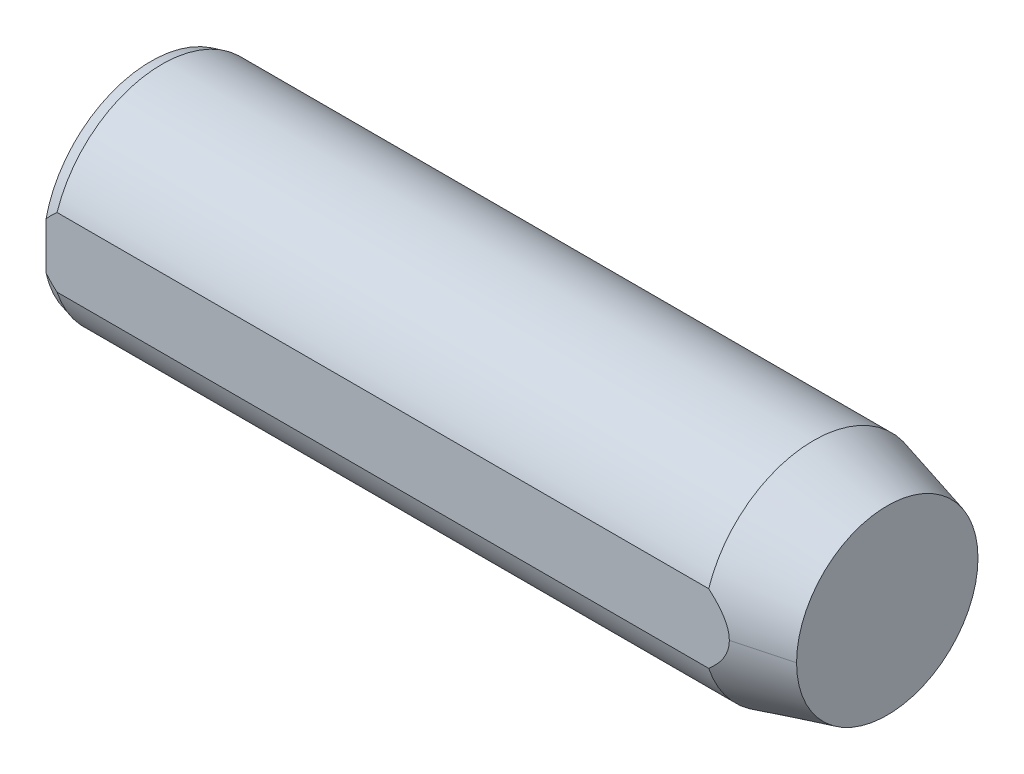
ISO-10303-21;
HEADER;
FILE_DESCRIPTION(('STEP AP214'),'2;1');
FILE_NAME('part.step','',(''),(''),'','','');
FILE_SCHEMA(('AUTOMOTIVE_DESIGN { 1 0 10303 214 1 1 1 1 }'));
ENDSEC;
DATA;
#1=APPLICATION_CONTEXT('core data for automotive mechanical design processes');
#2=APPLICATION_PROTOCOL_DEFINITION('international standard','automotive_design',2000,#1);
#3=PRODUCT_CONTEXT('',#1,'mechanical');
#4=PRODUCT('Part','Part','',(#3));
#5=PRODUCT_RELATED_PRODUCT_CATEGORY('part','',(#4));
#6=PRODUCT_DEFINITION_FORMATION('','',#4);
#7=PRODUCT_DEFINITION_CONTEXT('part definition',#1,'design');
#8=PRODUCT_DEFINITION('design','',#6,#7);
#9=PRODUCT_DEFINITION_SHAPE('','',#8);
#10=(LENGTH_UNIT() NAMED_UNIT(*) SI_UNIT(.MILLI.,.METRE.));
#11=(NAMED_UNIT(*) PLANE_ANGLE_UNIT() SI_UNIT($,.RADIAN.));
#12=(NAMED_UNIT(*) SI_UNIT($,.STERADIAN.) SOLID_ANGLE_UNIT());
#13=UNCERTAINTY_MEASURE_WITH_UNIT(LENGTH_MEASURE(1.E-05),#10,'distance_accuracy_value','');
#14=(GEOMETRIC_REPRESENTATION_CONTEXT(3) GLOBAL_UNCERTAINTY_ASSIGNED_CONTEXT((#13)) GLOBAL_UNIT_ASSIGNED_CONTEXT((#10,
#11,#12)) REPRESENTATION_CONTEXT('',''));
#15=CARTESIAN_POINT('',(0.,0.,0.));
#16=DIRECTION('',(0.,0.,1.));
#17=DIRECTION('',(1.,0.,0.));
#18=AXIS2_PLACEMENT_3D('',#15,#16,#17);
#19=CARTESIAN_POINT('',(-10.,0.,0.));
#20=DIRECTION('',(1.,0.,0.));
#21=DIRECTION('',(0.,0.,-1.));
#22=AXIS2_PLACEMENT_3D('',#19,#20,#21);
#23=PLANE('',#22);
#24=CARTESIAN_POINT('',(-10.,0.,0.));
#25=DIRECTION('',(1.,0.,0.));
#26=DIRECTION('',(0.,0.,-1.));
#27=AXIS2_PLACEMENT_3D('',#24,#25,#26);
#28=CIRCLE('',#27,2.9196152422707);
#29=CARTESIAN_POINT('',(-10.,-0.633761124477821,2.85));
#30=VERTEX_POINT('',#29);
#31=CARTESIAN_POINT('',(-10.,0.633761124477821,2.85));
#32=VERTEX_POINT('',#31);
#33=EDGE_CURVE('E13',#30,#32,#28,.T.);
#34=ORIENTED_EDGE('',*,*,#33,.F.);
#35=DIRECTION('',(0.,1.,0.));
#36=VECTOR('',#35,1.);
#37=CARTESIAN_POINT('',(-10.,-3.,2.85));
#38=LINE('',#37,#36);
#39=EDGE_CURVE('E33',#30,#32,#38,.T.);
#40=ORIENTED_EDGE('',*,*,#39,.T.);
#41=EDGE_LOOP('',(#34,#40));
#42=FACE_BOUND('',#41,.T.);
#43=CARTESIAN_POINT('',(-10.,0.,0.));
#44=DIRECTION('',(1.,0.,0.));
#45=DIRECTION('',(0.,0.,-1.));
#46=AXIS2_PLACEMENT_3D('',#43,#44,#45);
#47=CIRCLE('',#46,2.);
#48=CARTESIAN_POINT('',(-10.,0.,-2.));
#49=VERTEX_POINT('',#48);
#50=CARTESIAN_POINT('',(-10.,0.,2.));
#51=VERTEX_POINT('',#50);
#52=EDGE_CURVE('E290',#49,#51,#47,.T.);
#53=ORIENTED_EDGE('',*,*,#52,.T.);
#54=CARTESIAN_POINT('',(-10.,0.,0.));
#55=DIRECTION('',(1.,0.,0.));
#56=DIRECTION('',(0.,0.,-1.));
#57=AXIS2_PLACEMENT_3D('',#54,#55,#56);
#58=CIRCLE('',#57,2.);
#59=EDGE_CURVE('E286',#51,#49,#58,.T.);
#60=ORIENTED_EDGE('',*,*,#59,.T.);
#61=EDGE_LOOP('',(#53,#60));
#62=FACE_BOUND('',#61,.T.);
#63=ADVANCED_FACE('F25',(#42,#62),#23,.F.);
#64=CARTESIAN_POINT('',(-10.,0.,0.));
#65=DIRECTION('',(-1.,0.,0.));
#66=DIRECTION('',(0.,1.,0.));
#67=AXIS2_PLACEMENT_3D('',#64,#65,#66);
#68=CONICAL_SURFACE('',#67,2.,0.785398163397449);
#69=DIRECTION('',(-0.707106781186548,0.,-0.707106781186547));
#70=VECTOR('',#69,1.);
#71=CARTESIAN_POINT('',(-9.621,0.,-1.621));
#72=LINE('',#71,#70);
#73=CARTESIAN_POINT('',(-9.621,0.,-1.621));
#74=VERTEX_POINT('',#73);
#75=EDGE_CURVE('E281',#74,#49,#72,.T.);
#76=ORIENTED_EDGE('',*,*,#75,.T.);
#77=ORIENTED_EDGE('',*,*,#59,.F.);
#78=DIRECTION('',(-0.707106781186548,0.,0.707106781186547));
#79=VECTOR('',#78,1.);
#80=CARTESIAN_POINT('',(-9.621,0.,1.621));
#81=LINE('',#80,#79);
#82=CARTESIAN_POINT('',(-9.621,0.,1.621));
#83=VERTEX_POINT('',#82);
#84=EDGE_CURVE('E276',#83,#51,#81,.T.);
#85=ORIENTED_EDGE('',*,*,#84,.F.);
#86=CARTESIAN_POINT('',(-9.621,0.,0.));
#87=DIRECTION('',(1.,0.,0.));
#88=DIRECTION('',(0.,0.,-1.));
#89=AXIS2_PLACEMENT_3D('',#86,#87,#88);
#90=CIRCLE('',#89,1.621);
#91=EDGE_CURVE('E272',#83,#74,#90,.T.);
#92=ORIENTED_EDGE('',*,*,#91,.T.);
#93=EDGE_LOOP('',(#76,#77,#85,#92));
#94=FACE_BOUND('',#93,.T.);
#95=ADVANCED_FACE('F306',(#94),#68,.F.);
#96=CARTESIAN_POINT('',(0.4,0.,0.));
#97=DIRECTION('',(1.,0.,0.));
#98=DIRECTION('',(0.,1.,0.));
#99=AXIS2_PLACEMENT_3D('',#96,#97,#98);
#100=CYLINDRICAL_SURFACE('',#99,1.621);
#101=DIRECTION('',(1.,0.,0.));
#102=VECTOR('',#101,1.);
#103=CARTESIAN_POINT('',(-9.621,0.,1.621));
#104=LINE('',#103,#102);
#105=CARTESIAN_POINT('',(-0.53588478635638,0.,1.621));
#106=VERTEX_POINT('',#105);
#107=EDGE_CURVE('E268',#83,#106,#104,.T.);
#108=ORIENTED_EDGE('',*,*,#107,.T.);
#109=CARTESIAN_POINT('',(-0.53588478635638,0.,0.));
#110=DIRECTION('',(1.,0.,0.));
#111=DIRECTION('',(0.,0.,-1.));
#112=AXIS2_PLACEMENT_3D('',#109,#110,#111);
#113=CIRCLE('',#112,1.621);
#114=CARTESIAN_POINT('',(-0.53588478635638,0.,-1.621));
#115=VERTEX_POINT('',#114);
#116=EDGE_CURVE('E264',#106,#115,#113,.T.);
#117=ORIENTED_EDGE('',*,*,#116,.T.);
#118=DIRECTION('',(1.,0.,0.));
#119=VECTOR('',#118,1.);
#120=CARTESIAN_POINT('',(-9.621,0.,-1.621));
#121=LINE('',#120,#119);
#122=EDGE_CURVE('E259',#74,#115,#121,.T.);
#123=ORIENTED_EDGE('',*,*,#122,.F.);
#124=ORIENTED_EDGE('',*,*,#91,.F.);
#125=EDGE_LOOP('',(#108,#117,#123,#124));
#126=FACE_BOUND('',#125,.T.);
#127=ADVANCED_FACE('F310',(#126),#100,.F.);
#128=CARTESIAN_POINT('',(0.4,0.,0.));
#129=DIRECTION('',(1.,0.,0.));
#130=DIRECTION('',(0.,-1.,0.));
#131=AXIS2_PLACEMENT_3D('',#128,#129,#130);
#132=CYLINDRICAL_SURFACE('',#131,1.621);
#133=ORIENTED_EDGE('',*,*,#107,.F.);
#134=CARTESIAN_POINT('',(-9.621,0.,0.));
#135=DIRECTION('',(1.,0.,0.));
#136=DIRECTION('',(0.,0.,-1.));
#137=AXIS2_PLACEMENT_3D('',#134,#135,#136);
#138=CIRCLE('',#137,1.621);
#139=EDGE_CURVE('E254',#74,#83,#138,.T.);
#140=ORIENTED_EDGE('',*,*,#139,.F.);
#141=ORIENTED_EDGE('',*,*,#122,.T.);
#142=CARTESIAN_POINT('',(-0.53588478635638,0.,0.));
#143=DIRECTION('',(1.,0.,0.));
#144=DIRECTION('',(0.,0.,-1.));
#145=AXIS2_PLACEMENT_3D('',#142,#143,#144);
#146=CIRCLE('',#145,1.621);
#147=EDGE_CURVE('E249',#115,#106,#146,.T.);
#148=ORIENTED_EDGE('',*,*,#147,.T.);
#149=EDGE_LOOP('',(#133,#140,#141,#148));
#150=FACE_BOUND('',#149,.T.);
#151=ADVANCED_FACE('F314',(#150),#132,.F.);
#152=CARTESIAN_POINT('',(-0.53588478635638,0.,0.));
#153=DIRECTION('',(-1.,0.,0.));
#154=DIRECTION('',(0.,-1.,0.));
#155=AXIS2_PLACEMENT_3D('',#152,#153,#154);
#156=CONICAL_SURFACE('',#155,1.621,1.0471975511966);
#157=DIRECTION('',(-0.499999999999999,0.,0.866025403784439));
#158=VECTOR('',#157,1.);
#159=CARTESIAN_POINT('',(0.400000000000001,0.,0.));
#160=LINE('',#159,#158);
#161=CARTESIAN_POINT('',(0.400000000000002,0.,0.));
#162=VERTEX_POINT('',#161);
#163=EDGE_CURVE('E244',#162,#106,#160,.T.);
#164=ORIENTED_EDGE('',*,*,#163,.T.);
#165=ORIENTED_EDGE('',*,*,#147,.F.);
#166=DIRECTION('',(-0.499999999999999,0.,-0.866025403784439));
#167=VECTOR('',#166,1.);
#168=CARTESIAN_POINT('',(0.400000000000002,0.,0.));
#169=LINE('',#168,#167);
#170=EDGE_CURVE('E240',#162,#115,#169,.T.);
#171=ORIENTED_EDGE('',*,*,#170,.F.);
#172=EDGE_LOOP('',(#164,#165,#171));
#173=FACE_BOUND('',#172,.T.);
#174=ADVANCED_FACE('F317',(#173),#156,.F.);
#175=CARTESIAN_POINT('',(-0.53588478635638,0.,0.));
#176=DIRECTION('',(-1.,0.,0.));
#177=DIRECTION('',(0.,1.,0.));
#178=AXIS2_PLACEMENT_3D('',#175,#176,#177);
#179=CONICAL_SURFACE('',#178,1.621,1.0471975511966);
#180=ORIENTED_EDGE('',*,*,#170,.T.);
#181=ORIENTED_EDGE('',*,*,#116,.F.);
#182=ORIENTED_EDGE('',*,*,#163,.F.);
#183=EDGE_LOOP('',(#180,#181,#182));
#184=FACE_BOUND('',#183,.T.);
#185=ADVANCED_FACE('F319',(#184),#179,.F.);
#186=CARTESIAN_POINT('',(-10.,0.,0.));
#187=DIRECTION('',(-1.,0.,0.));
#188=DIRECTION('',(0.,-1.,0.));
#189=AXIS2_PLACEMENT_3D('',#186,#187,#188);
#190=CONICAL_SURFACE('',#189,2.,0.785398163397449);
#191=ORIENTED_EDGE('',*,*,#75,.F.);
#192=ORIENTED_EDGE('',*,*,#139,.T.);
#193=ORIENTED_EDGE('',*,*,#84,.T.);
#194=ORIENTED_EDGE('',*,*,#52,.F.);
#195=EDGE_LOOP('',(#191,#192,#193,#194));
#196=FACE_BOUND('',#195,.T.);
#197=ADVANCED_FACE('F205',(#196),#190,.F.);
#198=CARTESIAN_POINT('',(10.,-3.,2.85));
#199=DIRECTION('',(0.,0.,1.));
#200=DIRECTION('',(1.,0.,0.));
#201=AXIS2_PLACEMENT_3D('',#198,#199,#200);
#202=PLANE('',#201);
#203=CARTESIAN_POINT('',(-9.7,0.93674969975976,2.85));
#204=CARTESIAN_POINT('',(-9.71728597666189,0.92191618503927,2.85));
#205=CARTESIAN_POINT('',(-9.73469597401137,0.906651392904736,2.85));
#206=CARTESIAN_POINT('',(-9.84040464180992,0.811768925837938,2.85));
#207=CARTESIAN_POINT('',(-9.92492375154203,0.72643451280988,2.85));
#208=CARTESIAN_POINT('',(-10.,0.63376112447782,2.85));
#209=B_SPLINE_CURVE_WITH_KNOTS('',3,(#203,#204,#205,#206,#207,#208),.UNSPECIFIED.,.F.,.F.,(4,2,
4),(0.,0.160356880608805,1.),.UNSPECIFIED.);
#210=CARTESIAN_POINT('',(-9.7,0.93674969975976,2.85));
#211=VERTEX_POINT('',#210);
#212=EDGE_CURVE('E163',#211,#32,#209,.T.);
#213=ORIENTED_EDGE('',*,*,#212,.T.);
#214=ORIENTED_EDGE('',*,*,#39,.F.);
#215=CARTESIAN_POINT('',(-10.,-0.633761124477821,2.85));
#216=CARTESIAN_POINT('',(-9.91071860870959,-0.743969202476209,2.85));
#217=CARTESIAN_POINT('',(-9.80763646910444,-0.844384241900348,2.85));
#218=CARTESIAN_POINT('',(-9.7,-0.93674969975976,2.85));
#219=B_SPLINE_CURVE_WITH_KNOTS('',3,(#215,#216,#217,#218),.UNSPECIFIED.,.F.,.F.,(4,4),(0.,1.),.UNSPECIFIED.);
#220=CARTESIAN_POINT('',(-9.7,-0.93674969975976,2.85));
#221=VERTEX_POINT('',#220);
#222=EDGE_CURVE('E173',#30,#221,#219,.T.);
#223=ORIENTED_EDGE('',*,*,#222,.T.);
#224=DIRECTION('',(1.,0.,0.));
#225=VECTOR('',#224,1.);
#226=CARTESIAN_POINT('',(10.,-0.93674969975976,2.85));
#227=LINE('',#226,#225);
#228=CARTESIAN_POINT('',(8.,-0.93674969975976,2.85));
#229=VERTEX_POINT('',#228);
#230=EDGE_CURVE('E226',#221,#229,#227,.T.);
#231=ORIENTED_EDGE('',*,*,#230,.T.);
#232=CARTESIAN_POINT('',(8.,-0.93674969975976,2.85));
#233=CARTESIAN_POINT('',(8.12135075492618,-0.832615681488775,2.85));
#234=CARTESIAN_POINT('',(8.23655909654755,-0.718864757003339,2.85));
#235=CARTESIAN_POINT('',(8.40198216391975,-0.500727428946749,2.85));
#236=CARTESIAN_POINT('',(8.4621159004281,-0.401331677186365,2.85));
#237=CARTESIAN_POINT('',(8.53569644939717,-0.209870012430605,2.85));
#238=CARTESIAN_POINT('',(8.5560818220194,-0.118351706754072,2.85));
#239=CARTESIAN_POINT('',(8.55964614756718,-0.018119112278597,2.85));
#240=CARTESIAN_POINT('',(8.55979847577313,-0.00906422764529414,2.85));
#241=CARTESIAN_POINT('',(8.55978515210281,-1.40732325966397E-08,2.85));
#242=B_SPLINE_CURVE_WITH_KNOTS('',3,(#232,#233,#234,#235,#236,#237,#238,#239,#240,#241),
.UNSPECIFIED.,.F.,.F.,(4,2,2,2,4),(0.,0.213818178655566,0.366068301729629,0.48808607267157,
0.500179026022162),.UNSPECIFIED.);
#243=CARTESIAN_POINT('',(8.55980762113538,0.,2.85));
#244=VERTEX_POINT('',#243);
#245=EDGE_CURVE('E141',#229,#244,#242,.T.);
#246=ORIENTED_EDGE('',*,*,#245,.T.);
#247=CARTESIAN_POINT('',(8.55978515210281,-1.40732325966397E-08,2.85));
#248=CARTESIAN_POINT('',(8.55966364670392,0.0826612091046073,2.85));
#249=CARTESIAN_POINT('',(8.54576561409019,0.16609827848272,2.85));
#250=CARTESIAN_POINT('',(8.48442872255665,0.358246812895418,2.85));
#251=CARTESIAN_POINT('',(8.42494085179672,0.465065885146681,2.85));
#252=CARTESIAN_POINT('',(8.25445467110217,0.701290484890395,2.85));
#253=CARTESIAN_POINT('',(8.13060076534316,0.824678023793013,2.85));
#254=CARTESIAN_POINT('',(7.99999999999853,0.936749699761216,2.85));
#255=B_SPLINE_CURVE_WITH_KNOTS('',3,(#247,#248,#249,#250,#251,#252,#253,#254),.UNSPECIFIED.,.F.,
.F.,(4,2,2,4),(0.500179026022162,0.610460884215894,0.769883444120454,1.),.UNSPECIFIED.);
#256=CARTESIAN_POINT('',(7.99999999999853,0.936749699761213,2.85));
#257=VERTEX_POINT('',#256);
#258=EDGE_CURVE('E106',#244,#257,#255,.T.);
#259=ORIENTED_EDGE('',*,*,#258,.T.);
#260=DIRECTION('',(-1.,0.,0.));
#261=VECTOR('',#260,1.);
#262=CARTESIAN_POINT('',(10.,0.93674969975976,2.85));
#263=LINE('',#262,#261);
#264=EDGE_CURVE('E184',#257,#211,#263,.T.);
#265=ORIENTED_EDGE('',*,*,#264,.T.);
#266=EDGE_LOOP('',(#213,#214,#223,#231,#246,#259,#265));
#267=FACE_BOUND('',#266,.T.);
#268=ADVANCED_FACE('F195',(#267),#202,.T.);
#269=CARTESIAN_POINT('',(10.,0.,0.));
#270=DIRECTION('',(1.,0.,0.));
#271=DIRECTION('',(0.,0.,1.));
#272=AXIS2_PLACEMENT_3D('',#269,#270,#271);
#273=CYLINDRICAL_SURFACE('',#272,3.);
#274=ORIENTED_EDGE('',*,*,#264,.F.);
#275=CARTESIAN_POINT('',(8.,0.,0.));
#276=DIRECTION('',(1.,0.,0.));
#277=DIRECTION('',(0.,0.,-1.));
#278=AXIS2_PLACEMENT_3D('',#275,#276,#277);
#279=CIRCLE('',#278,3.);
#280=CARTESIAN_POINT('',(8.,0.,-3.));
#281=VERTEX_POINT('',#280);
#282=EDGE_CURVE('E180',#281,#257,#279,.T.);
#283=ORIENTED_EDGE('',*,*,#282,.F.);
#284=CARTESIAN_POINT('',(8.,0.,0.));
#285=DIRECTION('',(1.,0.,0.));
#286=DIRECTION('',(0.,0.,-1.));
#287=AXIS2_PLACEMENT_3D('',#284,#285,#286);
#288=CIRCLE('',#287,3.);
#289=EDGE_CURVE('E176',#229,#281,#288,.T.);
#290=ORIENTED_EDGE('',*,*,#289,.F.);
#291=ORIENTED_EDGE('',*,*,#230,.F.);
#292=CARTESIAN_POINT('',(-9.7,0.,0.));
#293=DIRECTION('',(1.,0.,0.));
#294=DIRECTION('',(0.,0.,-1.));
#295=AXIS2_PLACEMENT_3D('',#292,#293,#294);
#296=CIRCLE('',#295,3.);
#297=EDGE_CURVE('E148',#221,#211,#296,.T.);
#298=ORIENTED_EDGE('',*,*,#297,.T.);
#299=EDGE_LOOP('',(#274,#283,#290,#291,#298));
#300=FACE_BOUND('',#299,.T.);
#301=ADVANCED_FACE('F204',(#300),#273,.T.);
#302=CARTESIAN_POINT('',(-10.,0.,0.));
#303=DIRECTION('',(1.,0.,0.));
#304=DIRECTION('',(0.,0.,1.));
#305=AXIS2_PLACEMENT_3D('',#302,#303,#304);
#306=CONICAL_SURFACE('',#305,2.9196152422707,0.261799387799038);
#307=ORIENTED_EDGE('',*,*,#222,.F.);
#308=ORIENTED_EDGE('',*,*,#33,.T.);
#309=ORIENTED_EDGE('',*,*,#212,.F.);
#310=ORIENTED_EDGE('',*,*,#297,.F.);
#311=EDGE_LOOP('',(#307,#308,#309,#310));
#312=FACE_BOUND('',#311,.T.);
#313=ADVANCED_FACE('F130',(#312),#306,.T.);
#314=CARTESIAN_POINT('',(8.,0.,0.));
#315=DIRECTION('',(-1.,0.,0.));
#316=DIRECTION('',(0.,1.,0.));
#317=AXIS2_PLACEMENT_3D('',#314,#315,#316);
#318=CONICAL_SURFACE('',#317,3.,0.261799387799128);
#319=DIRECTION('',(-0.965925826289074,0.,-0.2588190451025));
#320=VECTOR('',#319,1.);
#321=CARTESIAN_POINT('',(10.,0.,-2.4641016151378));
#322=LINE('',#321,#320);
#323=CARTESIAN_POINT('',(10.,0.,-2.4641016151378));
#324=VERTEX_POINT('',#323);
#325=EDGE_CURVE('E97',#324,#281,#322,.T.);
#326=ORIENTED_EDGE('',*,*,#325,.F.);
#327=CARTESIAN_POINT('',(10.,0.,0.));
#328=DIRECTION('',(1.,0.,0.));
#329=DIRECTION('',(0.,0.,-1.));
#330=AXIS2_PLACEMENT_3D('',#327,#328,#329);
#331=CIRCLE('',#330,2.4641016151378);
#332=CARTESIAN_POINT('',(10.,0.,2.4641016151378));
#333=VERTEX_POINT('',#332);
#334=EDGE_CURVE('E89',#333,#324,#331,.T.);
#335=ORIENTED_EDGE('',*,*,#334,.F.);
#336=DIRECTION('',(-0.965925826289074,0.,0.2588190451025));
#337=VECTOR('',#336,1.);
#338=CARTESIAN_POINT('',(10.,0.,2.4641016151378));
#339=LINE('',#338,#337);
#340=EDGE_CURVE('E93',#333,#244,#339,.T.);
#341=ORIENTED_EDGE('',*,*,#340,.T.);
#342=ORIENTED_EDGE('',*,*,#245,.F.);
#343=ORIENTED_EDGE('',*,*,#289,.T.);
#344=EDGE_LOOP('',(#326,#335,#341,#342,#343));
#345=FACE_BOUND('',#344,.T.);
#346=ADVANCED_FACE('F91',(#345),#318,.T.);
#347=CARTESIAN_POINT('',(8.,0.,0.));
#348=DIRECTION('',(-1.,0.,0.));
#349=DIRECTION('',(0.,-1.,0.));
#350=AXIS2_PLACEMENT_3D('',#347,#348,#349);
#351=CONICAL_SURFACE('',#350,3.,0.261799387799128);
#352=ORIENTED_EDGE('',*,*,#325,.T.);
#353=ORIENTED_EDGE('',*,*,#282,.T.);
#354=ORIENTED_EDGE('',*,*,#258,.F.);
#355=ORIENTED_EDGE('',*,*,#340,.F.);
#356=CARTESIAN_POINT('',(10.,0.,0.));
#357=DIRECTION('',(1.,0.,0.));
#358=DIRECTION('',(0.,0.,-1.));
#359=AXIS2_PLACEMENT_3D('',#356,#357,#358);
#360=CIRCLE('',#359,2.4641016151378);
#361=EDGE_CURVE('E104',#324,#333,#360,.T.);
#362=ORIENTED_EDGE('',*,*,#361,.F.);
#363=EDGE_LOOP('',(#352,#353,#354,#355,#362));
#364=FACE_BOUND('',#363,.T.);
#365=ADVANCED_FACE('F103',(#364),#351,.T.);
#366=CARTESIAN_POINT('',(10.,2.4641016151378,0.));
#367=DIRECTION('',(-1.,0.,0.));
#368=DIRECTION('',(0.,0.,1.));
#369=AXIS2_PLACEMENT_3D('',#366,#367,#368);
#370=PLANE('',#369);
#371=ORIENTED_EDGE('',*,*,#361,.T.);
#372=ORIENTED_EDGE('',*,*,#334,.T.);
#373=EDGE_LOOP('',(#371,#372));
#374=FACE_BOUND('',#373,.T.);
#375=ADVANCED_FACE('F109',(#374),#370,.F.);
#376=CLOSED_SHELL('',(#63,#95,#127,#151,#174,#185,#197,#268,#301,#313,#346,#365,#375));
#377=MANIFOLD_SOLID_BREP('B1',#376);
#378=ADVANCED_BREP_SHAPE_REPRESENTATION('',(#18,#377),#14);
#379=SHAPE_DEFINITION_REPRESENTATION(#9,#378);
ENDSEC;
END-ISO-10303-21;
